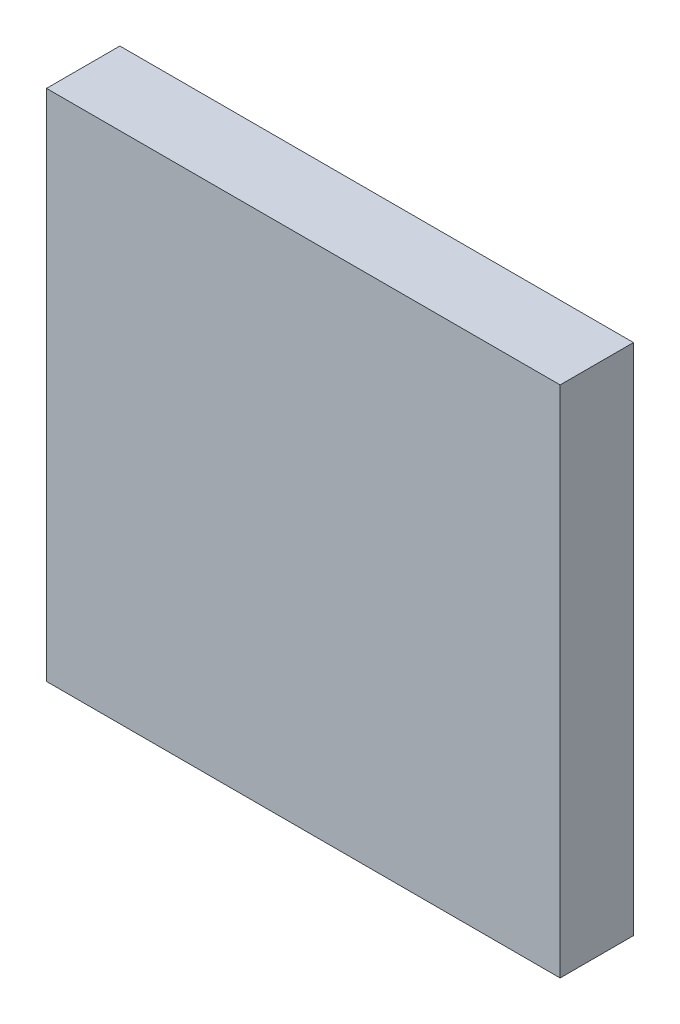
ISO-10303-21;
HEADER;
FILE_DESCRIPTION(('STEP AP214'),'2;1');
FILE_NAME('part.step','',(''),(''),'','','');
FILE_SCHEMA(('AUTOMOTIVE_DESIGN { 1 0 10303 214 1 1 1 1 }'));
ENDSEC;
DATA;
#1=APPLICATION_CONTEXT('core data for automotive mechanical design processes');
#2=APPLICATION_PROTOCOL_DEFINITION('international standard','automotive_design',2000,#1);
#3=PRODUCT_CONTEXT('',#1,'mechanical');
#4=PRODUCT('Part','Part','',(#3));
#5=PRODUCT_RELATED_PRODUCT_CATEGORY('part','',(#4));
#6=PRODUCT_DEFINITION_FORMATION('','',#4);
#7=PRODUCT_DEFINITION_CONTEXT('part definition',#1,'design');
#8=PRODUCT_DEFINITION('design','',#6,#7);
#9=PRODUCT_DEFINITION_SHAPE('','',#8);
#10=(LENGTH_UNIT() NAMED_UNIT(*) SI_UNIT(.MILLI.,.METRE.));
#11=(NAMED_UNIT(*) PLANE_ANGLE_UNIT() SI_UNIT($,.RADIAN.));
#12=(NAMED_UNIT(*) SI_UNIT($,.STERADIAN.) SOLID_ANGLE_UNIT());
#13=UNCERTAINTY_MEASURE_WITH_UNIT(LENGTH_MEASURE(1.E-05),#10,'distance_accuracy_value','');
#14=(GEOMETRIC_REPRESENTATION_CONTEXT(3) GLOBAL_UNCERTAINTY_ASSIGNED_CONTEXT((#13)) GLOBAL_UNIT_ASSIGNED_CONTEXT((#10,
#11,#12)) REPRESENTATION_CONTEXT('',''));
#15=CARTESIAN_POINT('',(0.,0.,0.));
#16=DIRECTION('',(0.,0.,1.));
#17=DIRECTION('',(1.,0.,0.));
#18=AXIS2_PLACEMENT_3D('',#15,#16,#17);
#19=CARTESIAN_POINT('',(3.5,-3.5,1.));
#20=DIRECTION('',(-1.,0.,0.));
#21=DIRECTION('',(0.,0.,1.));
#22=AXIS2_PLACEMENT_3D('',#19,#20,#21);
#23=PLANE('',#22);
#24=DIRECTION('',(0.,1.,0.));
#25=VECTOR('',#24,1.);
#26=CARTESIAN_POINT('',(3.5,-3.5,0.));
#27=LINE('',#26,#25);
#28=CARTESIAN_POINT('',(3.5,-3.5,0.));
#29=VERTEX_POINT('',#28);
#30=CARTESIAN_POINT('',(3.5,3.5,0.));
#31=VERTEX_POINT('',#30);
#32=EDGE_CURVE('E97',#29,#31,#27,.T.);
#33=ORIENTED_EDGE('',*,*,#32,.T.);
#34=DIRECTION('',(0.,0.,-1.));
#35=VECTOR('',#34,1.);
#36=CARTESIAN_POINT('',(3.5,3.5,1.));
#37=LINE('',#36,#35);
#38=CARTESIAN_POINT('',(3.5,3.5,1.));
#39=VERTEX_POINT('',#38);
#40=EDGE_CURVE('E11',#39,#31,#37,.T.);
#41=ORIENTED_EDGE('',*,*,#40,.F.);
#42=DIRECTION('',(0.,1.,0.));
#43=VECTOR('',#42,1.);
#44=CARTESIAN_POINT('',(3.5,-3.5,1.));
#45=LINE('',#44,#43);
#46=CARTESIAN_POINT('',(3.5,-3.5,1.));
#47=VERTEX_POINT('',#46);
#48=EDGE_CURVE('E85',#47,#39,#45,.T.);
#49=ORIENTED_EDGE('',*,*,#48,.F.);
#50=DIRECTION('',(0.,0.,-1.));
#51=VECTOR('',#50,1.);
#52=CARTESIAN_POINT('',(3.5,-3.5,1.));
#53=LINE('',#52,#51);
#54=EDGE_CURVE('E93',#47,#29,#53,.T.);
#55=ORIENTED_EDGE('',*,*,#54,.T.);
#56=EDGE_LOOP('',(#33,#41,#49,#55));
#57=FACE_BOUND('',#56,.T.);
#58=ADVANCED_FACE('F34',(#57),#23,.F.);
#59=CARTESIAN_POINT('',(-3.5,3.5,1.));
#60=DIRECTION('',(0.,-1.,0.));
#61=DIRECTION('',(0.,0.,-1.));
#62=AXIS2_PLACEMENT_3D('',#59,#60,#61);
#63=PLANE('',#62);
#64=DIRECTION('',(-1.,0.,0.));
#65=VECTOR('',#64,1.);
#66=CARTESIAN_POINT('',(-3.5,3.5,0.));
#67=LINE('',#66,#65);
#68=CARTESIAN_POINT('',(-3.5,3.5,0.));
#69=VERTEX_POINT('',#68);
#70=EDGE_CURVE('E89',#31,#69,#67,.T.);
#71=ORIENTED_EDGE('',*,*,#70,.T.);
#72=DIRECTION('',(0.,0.,-1.));
#73=VECTOR('',#72,1.);
#74=CARTESIAN_POINT('',(-3.5,3.5,1.));
#75=LINE('',#74,#73);
#76=CARTESIAN_POINT('',(-3.5,3.5,1.));
#77=VERTEX_POINT('',#76);
#78=EDGE_CURVE('E42',#77,#69,#75,.T.);
#79=ORIENTED_EDGE('',*,*,#78,.F.);
#80=DIRECTION('',(-1.,0.,0.));
#81=VECTOR('',#80,1.);
#82=CARTESIAN_POINT('',(-3.5,3.5,1.));
#83=LINE('',#82,#81);
#84=EDGE_CURVE('E80',#39,#77,#83,.T.);
#85=ORIENTED_EDGE('',*,*,#84,.F.);
#86=ORIENTED_EDGE('',*,*,#40,.T.);
#87=EDGE_LOOP('',(#71,#79,#85,#86));
#88=FACE_BOUND('',#87,.T.);
#89=ADVANCED_FACE('F88',(#88),#63,.F.);
#90=CARTESIAN_POINT('',(-3.5,-3.5,1.));
#91=DIRECTION('',(1.,0.,0.));
#92=DIRECTION('',(0.,0.,-1.));
#93=AXIS2_PLACEMENT_3D('',#90,#91,#92);
#94=PLANE('',#93);
#95=DIRECTION('',(0.,-1.,0.));
#96=VECTOR('',#95,1.);
#97=CARTESIAN_POINT('',(-3.5,-3.5,0.));
#98=LINE('',#97,#96);
#99=CARTESIAN_POINT('',(-3.5,-3.5,0.));
#100=VERTEX_POINT('',#99);
#101=EDGE_CURVE('E67',#69,#100,#98,.T.);
#102=ORIENTED_EDGE('',*,*,#101,.T.);
#103=DIRECTION('',(0.,0.,-1.));
#104=VECTOR('',#103,1.);
#105=CARTESIAN_POINT('',(-3.5,-3.5,1.));
#106=LINE('',#105,#104);
#107=CARTESIAN_POINT('',(-3.5,-3.5,1.));
#108=VERTEX_POINT('',#107);
#109=EDGE_CURVE('E90',#108,#100,#106,.T.);
#110=ORIENTED_EDGE('',*,*,#109,.F.);
#111=DIRECTION('',(0.,-1.,0.));
#112=VECTOR('',#111,1.);
#113=CARTESIAN_POINT('',(-3.5,-3.5,1.));
#114=LINE('',#113,#112);
#115=EDGE_CURVE('E83',#77,#108,#114,.T.);
#116=ORIENTED_EDGE('',*,*,#115,.F.);
#117=ORIENTED_EDGE('',*,*,#78,.T.);
#118=EDGE_LOOP('',(#102,#110,#116,#117));
#119=FACE_BOUND('',#118,.T.);
#120=ADVANCED_FACE('F91',(#119),#94,.F.);
#121=CARTESIAN_POINT('',(-3.5,-3.5,1.));
#122=DIRECTION('',(0.,1.,0.));
#123=DIRECTION('',(0.,0.,1.));
#124=AXIS2_PLACEMENT_3D('',#121,#122,#123);
#125=PLANE('',#124);
#126=DIRECTION('',(1.,0.,0.));
#127=VECTOR('',#126,1.);
#128=CARTESIAN_POINT('',(-3.5,-3.5,0.));
#129=LINE('',#128,#127);
#130=EDGE_CURVE('E73',#100,#29,#129,.T.);
#131=ORIENTED_EDGE('',*,*,#130,.T.);
#132=ORIENTED_EDGE('',*,*,#54,.F.);
#133=DIRECTION('',(1.,0.,0.));
#134=VECTOR('',#133,1.);
#135=CARTESIAN_POINT('',(-3.5,-3.5,1.));
#136=LINE('',#135,#134);
#137=EDGE_CURVE('E50',#108,#47,#136,.T.);
#138=ORIENTED_EDGE('',*,*,#137,.F.);
#139=ORIENTED_EDGE('',*,*,#109,.T.);
#140=EDGE_LOOP('',(#131,#132,#138,#139));
#141=FACE_BOUND('',#140,.T.);
#142=ADVANCED_FACE('F104',(#141),#125,.F.);
#143=CARTESIAN_POINT('',(0.,0.,1.));
#144=DIRECTION('',(0.,0.,-1.));
#145=DIRECTION('',(-1.,0.,0.));
#146=AXIS2_PLACEMENT_3D('',#143,#144,#145);
#147=PLANE('',#146);
#148=ORIENTED_EDGE('',*,*,#48,.T.);
#149=ORIENTED_EDGE('',*,*,#84,.T.);
#150=ORIENTED_EDGE('',*,*,#115,.T.);
#151=ORIENTED_EDGE('',*,*,#137,.T.);
#152=EDGE_LOOP('',(#148,#149,#150,#151));
#153=FACE_BOUND('',#152,.T.);
#154=ADVANCED_FACE('F81',(#153),#147,.F.);
#155=CARTESIAN_POINT('',(0.,0.,0.));
#156=DIRECTION('',(0.,0.,-1.));
#157=DIRECTION('',(-1.,0.,0.));
#158=AXIS2_PLACEMENT_3D('',#155,#156,#157);
#159=PLANE('',#158);
#160=ORIENTED_EDGE('',*,*,#32,.F.);
#161=ORIENTED_EDGE('',*,*,#130,.F.);
#162=ORIENTED_EDGE('',*,*,#101,.F.);
#163=ORIENTED_EDGE('',*,*,#70,.F.);
#164=EDGE_LOOP('',(#160,#161,#162,#163));
#165=FACE_BOUND('',#164,.T.);
#166=ADVANCED_FACE('F107',(#165),#159,.T.);
#167=CLOSED_SHELL('',(#58,#89,#120,#142,#154,#166));
#168=MANIFOLD_SOLID_BREP('B2',#167);
#169=ADVANCED_BREP_SHAPE_REPRESENTATION('',(#18,#168),#14);
#170=SHAPE_DEFINITION_REPRESENTATION(#9,#169);
ENDSEC;
END-ISO-10303-21;
